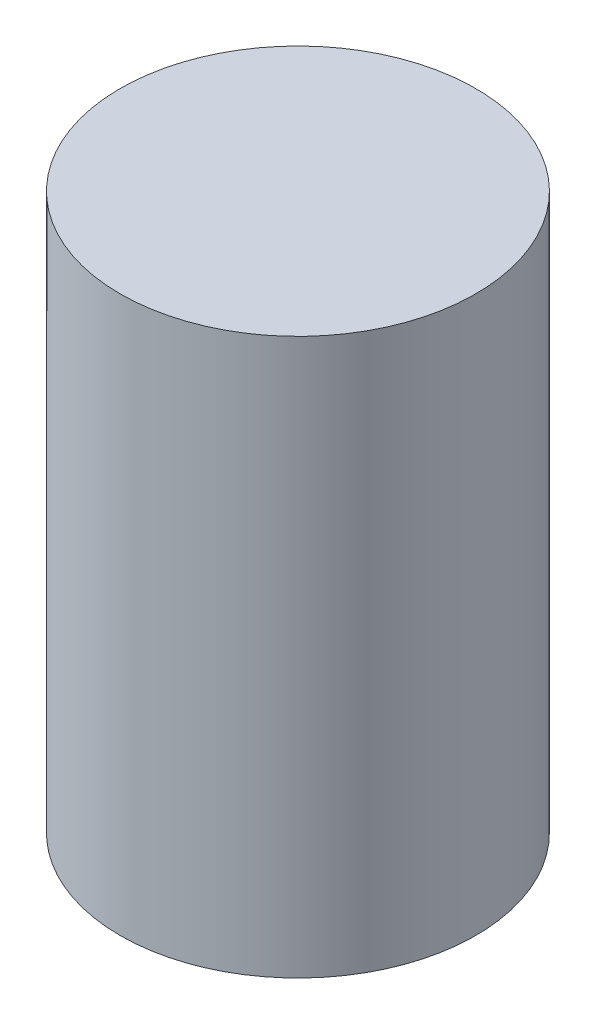
ISO-10303-21;
HEADER;
FILE_DESCRIPTION(('STEP AP214'),'2;1');
FILE_NAME('part.step','',(''),(''),'','','');
FILE_SCHEMA(('AUTOMOTIVE_DESIGN { 1 0 10303 214 1 1 1 1 }'));
ENDSEC;
DATA;
#1=APPLICATION_CONTEXT('core data for automotive mechanical design processes');
#2=APPLICATION_PROTOCOL_DEFINITION('international standard','automotive_design',2000,#1);
#3=PRODUCT_CONTEXT('',#1,'mechanical');
#4=PRODUCT('Part','Part','',(#3));
#5=PRODUCT_RELATED_PRODUCT_CATEGORY('part','',(#4));
#6=PRODUCT_DEFINITION_FORMATION('','',#4);
#7=PRODUCT_DEFINITION_CONTEXT('part definition',#1,'design');
#8=PRODUCT_DEFINITION('design','',#6,#7);
#9=PRODUCT_DEFINITION_SHAPE('','',#8);
#10=(LENGTH_UNIT() NAMED_UNIT(*) SI_UNIT(.MILLI.,.METRE.));
#11=(NAMED_UNIT(*) PLANE_ANGLE_UNIT() SI_UNIT($,.RADIAN.));
#12=(NAMED_UNIT(*) SI_UNIT($,.STERADIAN.) SOLID_ANGLE_UNIT());
#13=UNCERTAINTY_MEASURE_WITH_UNIT(LENGTH_MEASURE(1.E-05),#10,'distance_accuracy_value','');
#14=(GEOMETRIC_REPRESENTATION_CONTEXT(3) GLOBAL_UNCERTAINTY_ASSIGNED_CONTEXT((#13)) GLOBAL_UNIT_ASSIGNED_CONTEXT((#10,
#11,#12)) REPRESENTATION_CONTEXT('',''));
#15=CARTESIAN_POINT('',(0.,0.,0.));
#16=DIRECTION('',(0.,0.,1.));
#17=DIRECTION('',(1.,0.,0.));
#18=AXIS2_PLACEMENT_3D('',#15,#16,#17);
#19=CARTESIAN_POINT('',(0.,15.,0.));
#20=DIRECTION('',(0.,-1.,0.));
#21=DIRECTION('',(0.,0.,-1.));
#22=AXIS2_PLACEMENT_3D('',#19,#20,#21);
#23=CYLINDRICAL_SURFACE('',#22,4.8);
#24=CARTESIAN_POINT('',(0.,15.,0.));
#25=DIRECTION('',(0.,1.,0.));
#26=DIRECTION('',(0.,0.,1.));
#27=AXIS2_PLACEMENT_3D('',#24,#25,#26);
#28=CIRCLE('',#27,4.8);
#29=CARTESIAN_POINT('',(0.,15.,4.8));
#30=VERTEX_POINT('',#29);
#31=EDGE_CURVE('E11',#30,#30,#28,.T.);
#32=ORIENTED_EDGE('',*,*,#31,.F.);
#33=EDGE_LOOP('',(#32));
#34=FACE_BOUND('',#33,.T.);
#35=CARTESIAN_POINT('',(0.,0.,0.));
#36=DIRECTION('',(0.,1.,0.));
#37=DIRECTION('',(0.,0.,1.));
#38=AXIS2_PLACEMENT_3D('',#35,#36,#37);
#39=CIRCLE('',#38,4.8);
#40=CARTESIAN_POINT('',(0.,0.,4.8));
#41=VERTEX_POINT('',#40);
#42=EDGE_CURVE('E42',#41,#41,#39,.T.);
#43=ORIENTED_EDGE('',*,*,#42,.T.);
#44=EDGE_LOOP('',(#43));
#45=FACE_BOUND('',#44,.T.);
#46=ADVANCED_FACE('F39',(#34,#45),#23,.T.);
#47=CARTESIAN_POINT('',(0.,15.,0.));
#48=DIRECTION('',(0.,1.,0.));
#49=DIRECTION('',(0.,0.,1.));
#50=AXIS2_PLACEMENT_3D('',#47,#48,#49);
#51=PLANE('',#50);
#52=ORIENTED_EDGE('',*,*,#31,.T.);
#53=EDGE_LOOP('',(#52));
#54=FACE_BOUND('',#53,.T.);
#55=ADVANCED_FACE('F223',(#54),#51,.T.);
#56=CARTESIAN_POINT('',(0.,0.,0.));
#57=DIRECTION('',(0.,1.,0.));
#58=DIRECTION('',(0.,0.,1.));
#59=AXIS2_PLACEMENT_3D('',#56,#57,#58);
#60=PLANE('',#59);
#61=DIRECTION('',(1.,0.,0.));
#62=VECTOR('',#61,1.);
#63=CARTESIAN_POINT('',(-1.,0.,-2.5));
#64=LINE('',#63,#62);
#65=CARTESIAN_POINT('',(-1.,0.,-2.5));
#66=VERTEX_POINT('',#65);
#67=CARTESIAN_POINT('',(1.,0.,-2.5));
#68=VERTEX_POINT('',#67);
#69=EDGE_CURVE('E186',#66,#68,#64,.T.);
#70=ORIENTED_EDGE('',*,*,#69,.F.);
#71=DIRECTION('',(0.,0.,-1.));
#72=VECTOR('',#71,1.);
#73=CARTESIAN_POINT('',(-1.,0.,2.5));
#74=LINE('',#73,#72);
#75=CARTESIAN_POINT('',(-1.,0.,2.5));
#76=VERTEX_POINT('',#75);
#77=EDGE_CURVE('E196',#76,#66,#74,.T.);
#78=ORIENTED_EDGE('',*,*,#77,.F.);
#79=DIRECTION('',(1.,0.,0.));
#80=VECTOR('',#79,1.);
#81=CARTESIAN_POINT('',(-1.,0.,2.5));
#82=LINE('',#81,#80);
#83=CARTESIAN_POINT('',(1.,0.,2.5));
#84=VERTEX_POINT('',#83);
#85=EDGE_CURVE('E95',#76,#84,#82,.T.);
#86=ORIENTED_EDGE('',*,*,#85,.T.);
#87=DIRECTION('',(0.,0.,-1.));
#88=VECTOR('',#87,1.);
#89=CARTESIAN_POINT('',(1.,0.,2.5));
#90=LINE('',#89,#88);
#91=EDGE_CURVE('E151',#84,#68,#90,.T.);
#92=ORIENTED_EDGE('',*,*,#91,.T.);
#93=EDGE_LOOP('',(#70,#78,#86,#92));
#94=FACE_BOUND('',#93,.T.);
#95=ORIENTED_EDGE('',*,*,#42,.F.);
#96=EDGE_LOOP('',(#95));
#97=FACE_BOUND('',#96,.T.);
#98=ADVANCED_FACE('F193',(#94,#97),#60,.F.);
#99=CARTESIAN_POINT('',(-1.,0.,2.5));
#100=DIRECTION('',(0.,0.,1.));
#101=DIRECTION('',(1.,0.,0.));
#102=AXIS2_PLACEMENT_3D('',#99,#100,#101);
#103=PLANE('',#102);
#104=DIRECTION('',(0.,-1.,0.));
#105=VECTOR('',#104,1.);
#106=CARTESIAN_POINT('',(1.,0.,2.5));
#107=LINE('',#106,#105);
#108=CARTESIAN_POINT('',(1.,4.,2.5));
#109=VERTEX_POINT('',#108);
#110=EDGE_CURVE('E148',#109,#84,#107,.T.);
#111=ORIENTED_EDGE('',*,*,#110,.T.);
#112=ORIENTED_EDGE('',*,*,#85,.F.);
#113=DIRECTION('',(0.,-1.,0.));
#114=VECTOR('',#113,1.);
#115=CARTESIAN_POINT('',(-1.,0.,2.5));
#116=LINE('',#115,#114);
#117=CARTESIAN_POINT('',(-1.,4.,2.5));
#118=VERTEX_POINT('',#117);
#119=EDGE_CURVE('E173',#118,#76,#116,.T.);
#120=ORIENTED_EDGE('',*,*,#119,.F.);
#121=DIRECTION('',(1.,0.,0.));
#122=VECTOR('',#121,1.);
#123=CARTESIAN_POINT('',(-1.,4.,2.5));
#124=LINE('',#123,#122);
#125=EDGE_CURVE('E63',#118,#109,#124,.T.);
#126=ORIENTED_EDGE('',*,*,#125,.T.);
#127=EDGE_LOOP('',(#111,#112,#120,#126));
#128=FACE_BOUND('',#127,.T.);
#129=ADVANCED_FACE('F215',(#128),#103,.F.);
#130=CARTESIAN_POINT('',(-1.,4.,2.5));
#131=DIRECTION('',(0.,1.,0.));
#132=DIRECTION('',(0.,0.,1.));
#133=AXIS2_PLACEMENT_3D('',#130,#131,#132);
#134=PLANE('',#133);
#135=DIRECTION('',(0.,0.,1.));
#136=VECTOR('',#135,1.);
#137=CARTESIAN_POINT('',(1.,4.,2.5));
#138=LINE('',#137,#136);
#139=CARTESIAN_POINT('',(1.,4.,2.));
#140=VERTEX_POINT('',#139);
#141=EDGE_CURVE('E170',#140,#109,#138,.T.);
#142=ORIENTED_EDGE('',*,*,#141,.T.);
#143=ORIENTED_EDGE('',*,*,#125,.F.);
#144=DIRECTION('',(0.,0.,1.));
#145=VECTOR('',#144,1.);
#146=CARTESIAN_POINT('',(-1.,4.,2.5));
#147=LINE('',#146,#145);
#148=CARTESIAN_POINT('',(-1.,4.,2.));
#149=VERTEX_POINT('',#148);
#150=EDGE_CURVE('E133',#149,#118,#147,.T.);
#151=ORIENTED_EDGE('',*,*,#150,.F.);
#152=DIRECTION('',(1.,0.,0.));
#153=VECTOR('',#152,1.);
#154=CARTESIAN_POINT('',(-1.,4.,2.));
#155=LINE('',#154,#153);
#156=EDGE_CURVE('E124',#149,#140,#155,.T.);
#157=ORIENTED_EDGE('',*,*,#156,.T.);
#158=EDGE_LOOP('',(#142,#143,#151,#157));
#159=FACE_BOUND('',#158,.T.);
#160=ADVANCED_FACE('F214',(#159),#134,.F.);
#161=CARTESIAN_POINT('',(-1.,4.,2.));
#162=DIRECTION('',(0.,0.,1.));
#163=DIRECTION('',(1.,0.,0.));
#164=AXIS2_PLACEMENT_3D('',#161,#162,#163);
#165=PLANE('',#164);
#166=DIRECTION('',(0.,-1.,0.));
#167=VECTOR('',#166,1.);
#168=CARTESIAN_POINT('',(1.,4.,2.));
#169=LINE('',#168,#167);
#170=CARTESIAN_POINT('',(1.,8.,2.));
#171=VERTEX_POINT('',#170);
#172=EDGE_CURVE('E167',#171,#140,#169,.T.);
#173=ORIENTED_EDGE('',*,*,#172,.T.);
#174=ORIENTED_EDGE('',*,*,#156,.F.);
#175=DIRECTION('',(0.,-1.,0.));
#176=VECTOR('',#175,1.);
#177=CARTESIAN_POINT('',(-1.,4.,2.));
#178=LINE('',#177,#176);
#179=CARTESIAN_POINT('',(-1.,8.,2.));
#180=VERTEX_POINT('',#179);
#181=EDGE_CURVE('E128',#180,#149,#178,.T.);
#182=ORIENTED_EDGE('',*,*,#181,.F.);
#183=DIRECTION('',(1.,0.,0.));
#184=VECTOR('',#183,1.);
#185=CARTESIAN_POINT('',(-1.,8.,2.));
#186=LINE('',#185,#184);
#187=EDGE_CURVE('E112',#180,#171,#186,.T.);
#188=ORIENTED_EDGE('',*,*,#187,.T.);
#189=EDGE_LOOP('',(#173,#174,#182,#188));
#190=FACE_BOUND('',#189,.T.);
#191=ADVANCED_FACE('F129',(#190),#165,.F.);
#192=CARTESIAN_POINT('',(-1.,8.,2.));
#193=DIRECTION('',(0.,1.,0.));
#194=DIRECTION('',(0.,0.,1.));
#195=AXIS2_PLACEMENT_3D('',#192,#193,#194);
#196=PLANE('',#195);
#197=DIRECTION('',(0.,0.,1.));
#198=VECTOR('',#197,1.);
#199=CARTESIAN_POINT('',(1.,8.,2.));
#200=LINE('',#199,#198);
#201=CARTESIAN_POINT('',(1.,8.,-2.));
#202=VERTEX_POINT('',#201);
#203=EDGE_CURVE('E119',#202,#171,#200,.T.);
#204=ORIENTED_EDGE('',*,*,#203,.T.);
#205=ORIENTED_EDGE('',*,*,#187,.F.);
#206=DIRECTION('',(0.,0.,1.));
#207=VECTOR('',#206,1.);
#208=CARTESIAN_POINT('',(-1.,8.,2.));
#209=LINE('',#208,#207);
#210=CARTESIAN_POINT('',(-1.,8.,-2.));
#211=VERTEX_POINT('',#210);
#212=EDGE_CURVE('E116',#211,#180,#209,.T.);
#213=ORIENTED_EDGE('',*,*,#212,.F.);
#214=DIRECTION('',(1.,0.,0.));
#215=VECTOR('',#214,1.);
#216=CARTESIAN_POINT('',(-1.,8.,-2.));
#217=LINE('',#216,#215);
#218=EDGE_CURVE('E125',#211,#202,#217,.T.);
#219=ORIENTED_EDGE('',*,*,#218,.T.);
#220=EDGE_LOOP('',(#204,#205,#213,#219));
#221=FACE_BOUND('',#220,.T.);
#222=ADVANCED_FACE('F114',(#221),#196,.F.);
#223=CARTESIAN_POINT('',(-1.,4.,-2.));
#224=DIRECTION('',(0.,0.,-1.));
#225=DIRECTION('',(0.,1.,0.));
#226=AXIS2_PLACEMENT_3D('',#223,#224,#225);
#227=PLANE('',#226);
#228=DIRECTION('',(0.,1.,0.));
#229=VECTOR('',#228,1.);
#230=CARTESIAN_POINT('',(1.,4.,-2.));
#231=LINE('',#230,#229);
#232=CARTESIAN_POINT('',(1.,4.,-2.));
#233=VERTEX_POINT('',#232);
#234=EDGE_CURVE('E161',#233,#202,#231,.T.);
#235=ORIENTED_EDGE('',*,*,#234,.T.);
#236=ORIENTED_EDGE('',*,*,#218,.F.);
#237=DIRECTION('',(0.,1.,0.));
#238=VECTOR('',#237,1.);
#239=CARTESIAN_POINT('',(-1.,4.,-2.));
#240=LINE('',#239,#238);
#241=CARTESIAN_POINT('',(-1.,4.,-2.));
#242=VERTEX_POINT('',#241);
#243=EDGE_CURVE('E138',#242,#211,#240,.T.);
#244=ORIENTED_EDGE('',*,*,#243,.F.);
#245=DIRECTION('',(1.,0.,0.));
#246=VECTOR('',#245,1.);
#247=CARTESIAN_POINT('',(-1.,4.,-2.));
#248=LINE('',#247,#246);
#249=EDGE_CURVE('E180',#242,#233,#248,.T.);
#250=ORIENTED_EDGE('',*,*,#249,.T.);
#251=EDGE_LOOP('',(#235,#236,#244,#250));
#252=FACE_BOUND('',#251,.T.);
#253=ADVANCED_FACE('F211',(#252),#227,.F.);
#254=CARTESIAN_POINT('',(-1.,4.,-2.5));
#255=DIRECTION('',(0.,1.,0.));
#256=DIRECTION('',(0.,0.,1.));
#257=AXIS2_PLACEMENT_3D('',#254,#255,#256);
#258=PLANE('',#257);
#259=DIRECTION('',(0.,0.,1.));
#260=VECTOR('',#259,1.);
#261=CARTESIAN_POINT('',(1.,4.,-2.5));
#262=LINE('',#261,#260);
#263=CARTESIAN_POINT('',(1.,4.,-2.5));
#264=VERTEX_POINT('',#263);
#265=EDGE_CURVE('E157',#264,#233,#262,.T.);
#266=ORIENTED_EDGE('',*,*,#265,.T.);
#267=ORIENTED_EDGE('',*,*,#249,.F.);
#268=DIRECTION('',(0.,0.,1.));
#269=VECTOR('',#268,1.);
#270=CARTESIAN_POINT('',(-1.,4.,-2.5));
#271=LINE('',#270,#269);
#272=CARTESIAN_POINT('',(-1.,4.,-2.5));
#273=VERTEX_POINT('',#272);
#274=EDGE_CURVE('E142',#273,#242,#271,.T.);
#275=ORIENTED_EDGE('',*,*,#274,.F.);
#276=DIRECTION('',(1.,0.,0.));
#277=VECTOR('',#276,1.);
#278=CARTESIAN_POINT('',(-1.,4.,-2.5));
#279=LINE('',#278,#277);
#280=EDGE_CURVE('E183',#273,#264,#279,.T.);
#281=ORIENTED_EDGE('',*,*,#280,.T.);
#282=EDGE_LOOP('',(#266,#267,#275,#281));
#283=FACE_BOUND('',#282,.T.);
#284=ADVANCED_FACE('F208',(#283),#258,.F.);
#285=CARTESIAN_POINT('',(-1.,0.,-2.5));
#286=DIRECTION('',(0.,0.,-1.));
#287=DIRECTION('',(-1.,0.,0.));
#288=AXIS2_PLACEMENT_3D('',#285,#286,#287);
#289=PLANE('',#288);
#290=DIRECTION('',(0.,1.,0.));
#291=VECTOR('',#290,1.);
#292=CARTESIAN_POINT('',(1.,0.,-2.5));
#293=LINE('',#292,#291);
#294=EDGE_CURVE('E54',#68,#264,#293,.T.);
#295=ORIENTED_EDGE('',*,*,#294,.T.);
#296=ORIENTED_EDGE('',*,*,#280,.F.);
#297=DIRECTION('',(0.,1.,0.));
#298=VECTOR('',#297,1.);
#299=CARTESIAN_POINT('',(-1.,0.,-2.5));
#300=LINE('',#299,#298);
#301=EDGE_CURVE('E199',#66,#273,#300,.T.);
#302=ORIENTED_EDGE('',*,*,#301,.F.);
#303=ORIENTED_EDGE('',*,*,#69,.T.);
#304=EDGE_LOOP('',(#295,#296,#302,#303));
#305=FACE_BOUND('',#304,.T.);
#306=ADVANCED_FACE('F286',(#305),#289,.F.);
#307=CARTESIAN_POINT('',(-1.,0.,0.));
#308=DIRECTION('',(-1.,0.,0.));
#309=DIRECTION('',(0.,0.,1.));
#310=AXIS2_PLACEMENT_3D('',#307,#308,#309);
#311=PLANE('',#310);
#312=ORIENTED_EDGE('',*,*,#119,.T.);
#313=ORIENTED_EDGE('',*,*,#77,.T.);
#314=ORIENTED_EDGE('',*,*,#301,.T.);
#315=ORIENTED_EDGE('',*,*,#274,.T.);
#316=ORIENTED_EDGE('',*,*,#243,.T.);
#317=ORIENTED_EDGE('',*,*,#212,.T.);
#318=ORIENTED_EDGE('',*,*,#181,.T.);
#319=ORIENTED_EDGE('',*,*,#150,.T.);
#320=EDGE_LOOP('',(#312,#313,#314,#315,#316,#317,#318,#319));
#321=FACE_BOUND('',#320,.T.);
#322=ADVANCED_FACE('F135',(#321),#311,.F.);
#323=CARTESIAN_POINT('',(1.,0.,0.));
#324=DIRECTION('',(-1.,0.,0.));
#325=DIRECTION('',(0.,0.,1.));
#326=AXIS2_PLACEMENT_3D('',#323,#324,#325);
#327=PLANE('',#326);
#328=ORIENTED_EDGE('',*,*,#110,.F.);
#329=ORIENTED_EDGE('',*,*,#141,.F.);
#330=ORIENTED_EDGE('',*,*,#172,.F.);
#331=ORIENTED_EDGE('',*,*,#203,.F.);
#332=ORIENTED_EDGE('',*,*,#234,.F.);
#333=ORIENTED_EDGE('',*,*,#265,.F.);
#334=ORIENTED_EDGE('',*,*,#294,.F.);
#335=ORIENTED_EDGE('',*,*,#91,.F.);
#336=EDGE_LOOP('',(#328,#329,#330,#331,#332,#333,#334,#335));
#337=FACE_BOUND('',#336,.T.);
#338=ADVANCED_FACE('F212',(#337),#327,.T.);
#339=CLOSED_SHELL('',(#46,#55,#98,#129,#160,#191,#222,#253,#284,#306,#322,#338));
#340=MANIFOLD_SOLID_BREP('B2',#339);
#341=ADVANCED_BREP_SHAPE_REPRESENTATION('',(#18,#340),#14);
#342=SHAPE_DEFINITION_REPRESENTATION(#9,#341);
ENDSEC;
END-ISO-10303-21;
